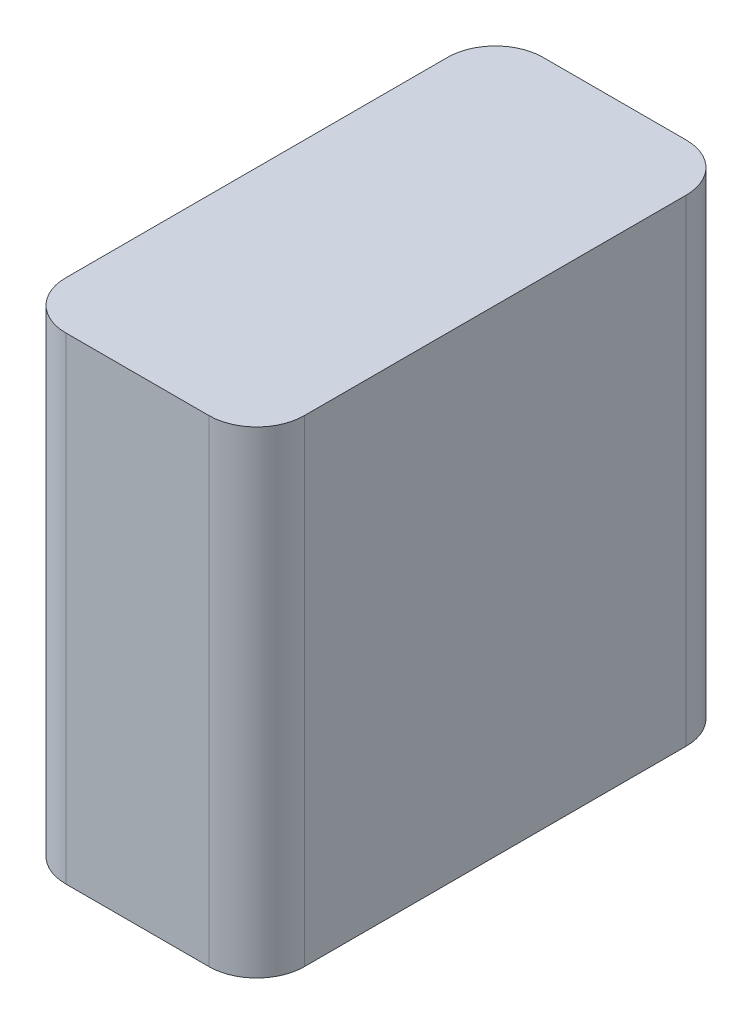
ISO-10303-21;
HEADER;
FILE_DESCRIPTION(('STEP AP214'),'2;1');
FILE_NAME('part.step','',(''),(''),'','','');
FILE_SCHEMA(('AUTOMOTIVE_DESIGN { 1 0 10303 214 1 1 1 1 }'));
ENDSEC;
DATA;
#1=APPLICATION_CONTEXT('core data for automotive mechanical design processes');
#2=APPLICATION_PROTOCOL_DEFINITION('international standard','automotive_design',2000,#1);
#3=PRODUCT_CONTEXT('',#1,'mechanical');
#4=PRODUCT('Part','Part','',(#3));
#5=PRODUCT_RELATED_PRODUCT_CATEGORY('part','',(#4));
#6=PRODUCT_DEFINITION_FORMATION('','',#4);
#7=PRODUCT_DEFINITION_CONTEXT('part definition',#1,'design');
#8=PRODUCT_DEFINITION('design','',#6,#7);
#9=PRODUCT_DEFINITION_SHAPE('','',#8);
#10=(LENGTH_UNIT() NAMED_UNIT(*) SI_UNIT(.MILLI.,.METRE.));
#11=(NAMED_UNIT(*) PLANE_ANGLE_UNIT() SI_UNIT($,.RADIAN.));
#12=(NAMED_UNIT(*) SI_UNIT($,.STERADIAN.) SOLID_ANGLE_UNIT());
#13=UNCERTAINTY_MEASURE_WITH_UNIT(LENGTH_MEASURE(1.E-05),#10,'distance_accuracy_value','');
#14=(GEOMETRIC_REPRESENTATION_CONTEXT(3) GLOBAL_UNCERTAINTY_ASSIGNED_CONTEXT((#13)) GLOBAL_UNIT_ASSIGNED_CONTEXT((#10,
#11,#12)) REPRESENTATION_CONTEXT('',''));
#15=CARTESIAN_POINT('',(0.,0.,0.));
#16=DIRECTION('',(0.,0.,1.));
#17=DIRECTION('',(1.,0.,0.));
#18=AXIS2_PLACEMENT_3D('',#15,#16,#17);
#19=CARTESIAN_POINT('',(5.,-20.,10.));
#20=DIRECTION('',(1.,0.,0.));
#21=DIRECTION('',(0.,0.,-1.));
#22=AXIS2_PLACEMENT_3D('',#19,#20,#21);
#23=PLANE('',#22);
#24=DIRECTION('',(0.,0.,-1.));
#25=VECTOR('',#24,1.);
#26=CARTESIAN_POINT('',(5.,-20.,10.));
#27=LINE('',#26,#25);
#28=CARTESIAN_POINT('',(5.,-20.,8.));
#29=VERTEX_POINT('',#28);
#30=CARTESIAN_POINT('',(5.,-20.,-8.));
#31=VERTEX_POINT('',#30);
#32=EDGE_CURVE('E156',#29,#31,#27,.T.);
#33=ORIENTED_EDGE('',*,*,#32,.T.);
#34=DIRECTION('',(0.,1.,0.));
#35=VECTOR('',#34,1.);
#36=CARTESIAN_POINT('',(5.,-20.,-8.));
#37=LINE('',#36,#35);
#38=CARTESIAN_POINT('',(5.,0.,-8.));
#39=VERTEX_POINT('',#38);
#40=EDGE_CURVE('E152',#31,#39,#37,.T.);
#41=ORIENTED_EDGE('',*,*,#40,.T.);
#42=DIRECTION('',(0.,0.,-1.));
#43=VECTOR('',#42,1.);
#44=CARTESIAN_POINT('',(5.,0.,10.));
#45=LINE('',#44,#43);
#46=CARTESIAN_POINT('',(5.,0.,8.));
#47=VERTEX_POINT('',#46);
#48=EDGE_CURVE('E105',#47,#39,#45,.T.);
#49=ORIENTED_EDGE('',*,*,#48,.F.);
#50=DIRECTION('',(0.,1.,0.));
#51=VECTOR('',#50,1.);
#52=CARTESIAN_POINT('',(5.,-20.,8.));
#53=LINE('',#52,#51);
#54=EDGE_CURVE('E150',#47,#29,#53,.F.);
#55=ORIENTED_EDGE('',*,*,#54,.T.);
#56=EDGE_LOOP('',(#33,#41,#49,#55));
#57=FACE_BOUND('',#56,.T.);
#58=ADVANCED_FACE('F34',(#57),#23,.T.);
#59=CARTESIAN_POINT('',(-5.,-20.,10.));
#60=DIRECTION('',(0.,0.,1.));
#61=DIRECTION('',(1.,0.,0.));
#62=AXIS2_PLACEMENT_3D('',#59,#60,#61);
#63=PLANE('',#62);
#64=DIRECTION('',(1.,0.,0.));
#65=VECTOR('',#64,1.);
#66=CARTESIAN_POINT('',(-5.,-20.,10.));
#67=LINE('',#66,#65);
#68=CARTESIAN_POINT('',(-3.,-20.,10.));
#69=VERTEX_POINT('',#68);
#70=CARTESIAN_POINT('',(3.,-20.,10.));
#71=VERTEX_POINT('',#70);
#72=EDGE_CURVE('E126',#69,#71,#67,.T.);
#73=ORIENTED_EDGE('',*,*,#72,.T.);
#74=DIRECTION('',(0.,1.,0.));
#75=VECTOR('',#74,1.);
#76=CARTESIAN_POINT('',(3.,-20.,10.));
#77=LINE('',#76,#75);
#78=CARTESIAN_POINT('',(3.,0.,10.));
#79=VERTEX_POINT('',#78);
#80=EDGE_CURVE('E11',#71,#79,#77,.T.);
#81=ORIENTED_EDGE('',*,*,#80,.T.);
#82=DIRECTION('',(1.,0.,0.));
#83=VECTOR('',#82,1.);
#84=CARTESIAN_POINT('',(-5.,0.,10.));
#85=LINE('',#84,#83);
#86=CARTESIAN_POINT('',(-3.,0.,10.));
#87=VERTEX_POINT('',#86);
#88=EDGE_CURVE('E133',#87,#79,#85,.T.);
#89=ORIENTED_EDGE('',*,*,#88,.F.);
#90=DIRECTION('',(0.,1.,0.));
#91=VECTOR('',#90,1.);
#92=CARTESIAN_POINT('',(-3.,-20.,10.));
#93=LINE('',#92,#91);
#94=EDGE_CURVE('E42',#87,#69,#93,.F.);
#95=ORIENTED_EDGE('',*,*,#94,.T.);
#96=EDGE_LOOP('',(#73,#81,#89,#95));
#97=FACE_BOUND('',#96,.T.);
#98=ADVANCED_FACE('F184',(#97),#63,.T.);
#99=CARTESIAN_POINT('',(-5.,-20.,10.));
#100=DIRECTION('',(-1.,0.,0.));
#101=DIRECTION('',(0.,0.,1.));
#102=AXIS2_PLACEMENT_3D('',#99,#100,#101);
#103=PLANE('',#102);
#104=DIRECTION('',(0.,0.,1.));
#105=VECTOR('',#104,1.);
#106=CARTESIAN_POINT('',(-5.,0.,10.));
#107=LINE('',#106,#105);
#108=CARTESIAN_POINT('',(-5.,0.,-8.));
#109=VERTEX_POINT('',#108);
#110=CARTESIAN_POINT('',(-5.,0.,8.));
#111=VERTEX_POINT('',#110);
#112=EDGE_CURVE('E121',#109,#111,#107,.T.);
#113=ORIENTED_EDGE('',*,*,#112,.F.);
#114=DIRECTION('',(0.,1.,0.));
#115=VECTOR('',#114,1.);
#116=CARTESIAN_POINT('',(-5.,-20.,-8.));
#117=LINE('',#116,#115);
#118=CARTESIAN_POINT('',(-5.,-20.,-8.));
#119=VERTEX_POINT('',#118);
#120=EDGE_CURVE('E142',#109,#119,#117,.F.);
#121=ORIENTED_EDGE('',*,*,#120,.T.);
#122=DIRECTION('',(0.,0.,1.));
#123=VECTOR('',#122,1.);
#124=CARTESIAN_POINT('',(-5.,-20.,10.));
#125=LINE('',#124,#123);
#126=CARTESIAN_POINT('',(-5.,-20.,8.));
#127=VERTEX_POINT('',#126);
#128=EDGE_CURVE('E130',#119,#127,#125,.T.);
#129=ORIENTED_EDGE('',*,*,#128,.T.);
#130=DIRECTION('',(0.,1.,0.));
#131=VECTOR('',#130,1.);
#132=CARTESIAN_POINT('',(-5.,-20.,8.));
#133=LINE('',#132,#131);
#134=EDGE_CURVE('E139',#127,#111,#133,.T.);
#135=ORIENTED_EDGE('',*,*,#134,.T.);
#136=EDGE_LOOP('',(#113,#121,#129,#135));
#137=FACE_BOUND('',#136,.T.);
#138=ADVANCED_FACE('F168',(#137),#103,.T.);
#139=CARTESIAN_POINT('',(-5.,-20.,-10.));
#140=DIRECTION('',(0.,0.,-1.));
#141=DIRECTION('',(-1.,0.,0.));
#142=AXIS2_PLACEMENT_3D('',#139,#140,#141);
#143=PLANE('',#142);
#144=DIRECTION('',(-1.,0.,0.));
#145=VECTOR('',#144,1.);
#146=CARTESIAN_POINT('',(-5.,-20.,-10.));
#147=LINE('',#146,#145);
#148=CARTESIAN_POINT('',(3.,-20.,-10.));
#149=VERTEX_POINT('',#148);
#150=CARTESIAN_POINT('',(-3.,-20.,-10.));
#151=VERTEX_POINT('',#150);
#152=EDGE_CURVE('E157',#149,#151,#147,.T.);
#153=ORIENTED_EDGE('',*,*,#152,.T.);
#154=DIRECTION('',(0.,1.,0.));
#155=VECTOR('',#154,1.);
#156=CARTESIAN_POINT('',(-3.,-20.,-10.));
#157=LINE('',#156,#155);
#158=CARTESIAN_POINT('',(-3.,0.,-10.));
#159=VERTEX_POINT('',#158);
#160=EDGE_CURVE('E120',#151,#159,#157,.T.);
#161=ORIENTED_EDGE('',*,*,#160,.T.);
#162=DIRECTION('',(-1.,0.,0.));
#163=VECTOR('',#162,1.);
#164=CARTESIAN_POINT('',(-5.,0.,-10.));
#165=LINE('',#164,#163);
#166=CARTESIAN_POINT('',(3.,0.,-10.));
#167=VERTEX_POINT('',#166);
#168=EDGE_CURVE('E103',#167,#159,#165,.T.);
#169=ORIENTED_EDGE('',*,*,#168,.F.);
#170=DIRECTION('',(0.,1.,0.));
#171=VECTOR('',#170,1.);
#172=CARTESIAN_POINT('',(3.,-20.,-10.));
#173=LINE('',#172,#171);
#174=EDGE_CURVE('E117',#167,#149,#173,.F.);
#175=ORIENTED_EDGE('',*,*,#174,.T.);
#176=EDGE_LOOP('',(#153,#161,#169,#175));
#177=FACE_BOUND('',#176,.T.);
#178=ADVANCED_FACE('F116',(#177),#143,.T.);
#179=CARTESIAN_POINT('',(0.,-20.,0.));
#180=DIRECTION('',(0.,-1.,0.));
#181=DIRECTION('',(0.,0.,-1.));
#182=AXIS2_PLACEMENT_3D('',#179,#180,#181);
#183=PLANE('',#182);
#184=ORIENTED_EDGE('',*,*,#128,.F.);
#185=CARTESIAN_POINT('',(-3.,-20.,-8.));
#186=DIRECTION('',(0.,-1.,0.));
#187=DIRECTION('',(0.,0.,-1.));
#188=AXIS2_PLACEMENT_3D('',#185,#186,#187);
#189=CIRCLE('',#188,2.);
#190=EDGE_CURVE('E148',#119,#151,#189,.T.);
#191=ORIENTED_EDGE('',*,*,#190,.T.);
#192=ORIENTED_EDGE('',*,*,#152,.F.);
#193=CARTESIAN_POINT('',(3.,-20.,-8.));
#194=DIRECTION('',(0.,-1.,0.));
#195=DIRECTION('',(0.,0.,-1.));
#196=AXIS2_PLACEMENT_3D('',#193,#194,#195);
#197=CIRCLE('',#196,2.);
#198=EDGE_CURVE('E125',#149,#31,#197,.T.);
#199=ORIENTED_EDGE('',*,*,#198,.T.);
#200=ORIENTED_EDGE('',*,*,#32,.F.);
#201=CARTESIAN_POINT('',(3.,-20.,8.));
#202=DIRECTION('',(0.,-1.,0.));
#203=DIRECTION('',(0.,0.,-1.));
#204=AXIS2_PLACEMENT_3D('',#201,#202,#203);
#205=CIRCLE('',#204,2.);
#206=EDGE_CURVE('E49',#29,#71,#205,.T.);
#207=ORIENTED_EDGE('',*,*,#206,.T.);
#208=ORIENTED_EDGE('',*,*,#72,.F.);
#209=CARTESIAN_POINT('',(-3.,-20.,8.));
#210=DIRECTION('',(0.,-1.,0.));
#211=DIRECTION('',(0.,0.,-1.));
#212=AXIS2_PLACEMENT_3D('',#209,#210,#211);
#213=CIRCLE('',#212,2.);
#214=EDGE_CURVE('E144',#69,#127,#213,.T.);
#215=ORIENTED_EDGE('',*,*,#214,.T.);
#216=EDGE_LOOP('',(#184,#191,#192,#199,#200,#207,#208,#215));
#217=FACE_BOUND('',#216,.T.);
#218=ADVANCED_FACE('F174',(#217),#183,.T.);
#219=CARTESIAN_POINT('',(0.,0.,0.));
#220=DIRECTION('',(0.,-1.,0.));
#221=DIRECTION('',(0.,0.,-1.));
#222=AXIS2_PLACEMENT_3D('',#219,#220,#221);
#223=PLANE('',#222);
#224=ORIENTED_EDGE('',*,*,#168,.T.);
#225=CARTESIAN_POINT('',(-3.,0.,-8.));
#226=DIRECTION('',(0.,-1.,0.));
#227=DIRECTION('',(0.,0.,-1.));
#228=AXIS2_PLACEMENT_3D('',#225,#226,#227);
#229=CIRCLE('',#228,2.);
#230=EDGE_CURVE('E110',#159,#109,#229,.F.);
#231=ORIENTED_EDGE('',*,*,#230,.T.);
#232=ORIENTED_EDGE('',*,*,#112,.T.);
#233=CARTESIAN_POINT('',(-3.,0.,8.));
#234=DIRECTION('',(0.,-1.,0.));
#235=DIRECTION('',(0.,0.,-1.));
#236=AXIS2_PLACEMENT_3D('',#233,#234,#235);
#237=CIRCLE('',#236,2.);
#238=EDGE_CURVE('E128',#111,#87,#237,.F.);
#239=ORIENTED_EDGE('',*,*,#238,.T.);
#240=ORIENTED_EDGE('',*,*,#88,.T.);
#241=CARTESIAN_POINT('',(3.,0.,8.));
#242=DIRECTION('',(0.,-1.,0.));
#243=DIRECTION('',(0.,0.,-1.));
#244=AXIS2_PLACEMENT_3D('',#241,#242,#243);
#245=CIRCLE('',#244,2.);
#246=EDGE_CURVE('E111',#79,#47,#245,.F.);
#247=ORIENTED_EDGE('',*,*,#246,.T.);
#248=ORIENTED_EDGE('',*,*,#48,.T.);
#249=CARTESIAN_POINT('',(3.,0.,-8.));
#250=DIRECTION('',(0.,-1.,0.));
#251=DIRECTION('',(0.,0.,-1.));
#252=AXIS2_PLACEMENT_3D('',#249,#250,#251);
#253=CIRCLE('',#252,2.);
#254=EDGE_CURVE('E100',#39,#167,#253,.F.);
#255=ORIENTED_EDGE('',*,*,#254,.T.);
#256=EDGE_LOOP('',(#224,#231,#232,#239,#240,#247,#248,#255));
#257=FACE_BOUND('',#256,.T.);
#258=ADVANCED_FACE('F102',(#257),#223,.F.);
#259=CARTESIAN_POINT('',(-3.,-20.,-8.));
#260=DIRECTION('',(0.,1.,0.));
#261=DIRECTION('',(0.,0.,1.));
#262=AXIS2_PLACEMENT_3D('',#259,#260,#261);
#263=CYLINDRICAL_SURFACE('',#262,2.);
#264=ORIENTED_EDGE('',*,*,#190,.F.);
#265=ORIENTED_EDGE('',*,*,#120,.F.);
#266=ORIENTED_EDGE('',*,*,#230,.F.);
#267=ORIENTED_EDGE('',*,*,#160,.F.);
#268=EDGE_LOOP('',(#264,#265,#266,#267));
#269=FACE_BOUND('',#268,.T.);
#270=ADVANCED_FACE('F173',(#269),#263,.T.);
#271=CARTESIAN_POINT('',(3.,-20.,-8.));
#272=DIRECTION('',(0.,1.,0.));
#273=DIRECTION('',(0.,0.,1.));
#274=AXIS2_PLACEMENT_3D('',#271,#272,#273);
#275=CYLINDRICAL_SURFACE('',#274,2.);
#276=ORIENTED_EDGE('',*,*,#198,.F.);
#277=ORIENTED_EDGE('',*,*,#174,.F.);
#278=ORIENTED_EDGE('',*,*,#254,.F.);
#279=ORIENTED_EDGE('',*,*,#40,.F.);
#280=EDGE_LOOP('',(#276,#277,#278,#279));
#281=FACE_BOUND('',#280,.T.);
#282=ADVANCED_FACE('F124',(#281),#275,.T.);
#283=CARTESIAN_POINT('',(3.,-20.,8.));
#284=DIRECTION('',(0.,1.,0.));
#285=DIRECTION('',(0.,0.,1.));
#286=AXIS2_PLACEMENT_3D('',#283,#284,#285);
#287=CYLINDRICAL_SURFACE('',#286,2.);
#288=ORIENTED_EDGE('',*,*,#206,.F.);
#289=ORIENTED_EDGE('',*,*,#54,.F.);
#290=ORIENTED_EDGE('',*,*,#246,.F.);
#291=ORIENTED_EDGE('',*,*,#80,.F.);
#292=EDGE_LOOP('',(#288,#289,#290,#291));
#293=FACE_BOUND('',#292,.T.);
#294=ADVANCED_FACE('F178',(#293),#287,.T.);
#295=CARTESIAN_POINT('',(-3.,-20.,8.));
#296=DIRECTION('',(0.,1.,0.));
#297=DIRECTION('',(0.,0.,1.));
#298=AXIS2_PLACEMENT_3D('',#295,#296,#297);
#299=CYLINDRICAL_SURFACE('',#298,2.);
#300=ORIENTED_EDGE('',*,*,#214,.F.);
#301=ORIENTED_EDGE('',*,*,#94,.F.);
#302=ORIENTED_EDGE('',*,*,#238,.F.);
#303=ORIENTED_EDGE('',*,*,#134,.F.);
#304=EDGE_LOOP('',(#300,#301,#302,#303));
#305=FACE_BOUND('',#304,.T.);
#306=ADVANCED_FACE('F36',(#305),#299,.T.);
#307=CLOSED_SHELL('',(#58,#98,#138,#178,#218,#258,#270,#282,#294,#306));
#308=MANIFOLD_SOLID_BREP('B2',#307);
#309=ADVANCED_BREP_SHAPE_REPRESENTATION('',(#18,#308),#14);
#310=SHAPE_DEFINITION_REPRESENTATION(#9,#309);
ENDSEC;
END-ISO-10303-21;
